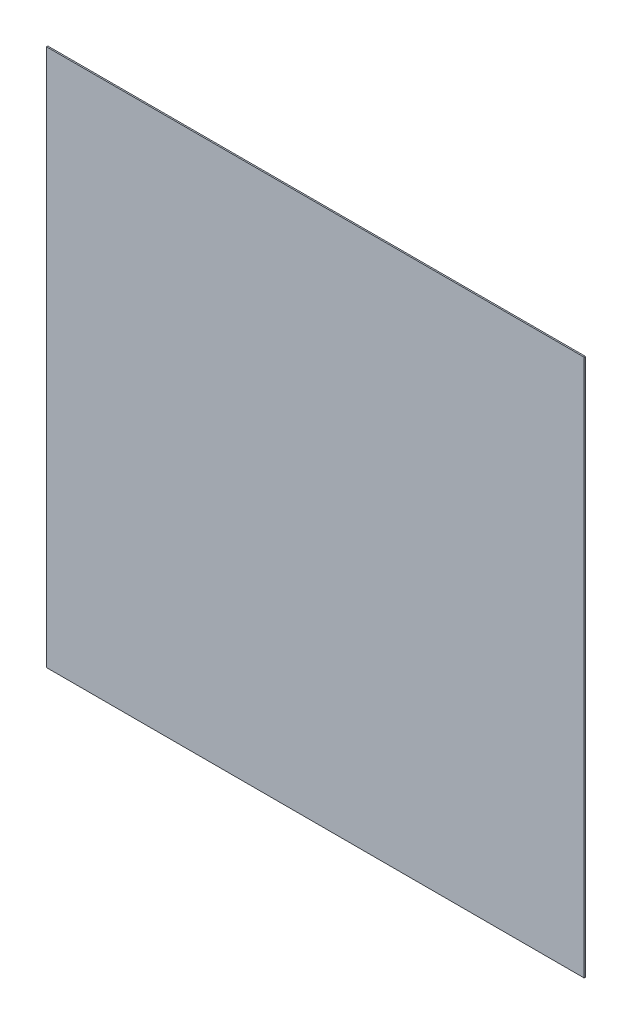
ISO-10303-21;
HEADER;
FILE_DESCRIPTION(('STEP AP214'),'2;1');
FILE_NAME('part.step','',(''),(''),'','','');
FILE_SCHEMA(('AUTOMOTIVE_DESIGN { 1 0 10303 214 1 1 1 1 }'));
ENDSEC;
DATA;
#1=APPLICATION_CONTEXT('core data for automotive mechanical design processes');
#2=APPLICATION_PROTOCOL_DEFINITION('international standard','automotive_design',2000,#1);
#3=PRODUCT_CONTEXT('',#1,'mechanical');
#4=PRODUCT('Part','Part','',(#3));
#5=PRODUCT_RELATED_PRODUCT_CATEGORY('part','',(#4));
#6=PRODUCT_DEFINITION_FORMATION('','',#4);
#7=PRODUCT_DEFINITION_CONTEXT('part definition',#1,'design');
#8=PRODUCT_DEFINITION('design','',#6,#7);
#9=PRODUCT_DEFINITION_SHAPE('','',#8);
#10=(LENGTH_UNIT() NAMED_UNIT(*) SI_UNIT(.MILLI.,.METRE.));
#11=(NAMED_UNIT(*) PLANE_ANGLE_UNIT() SI_UNIT($,.RADIAN.));
#12=(NAMED_UNIT(*) SI_UNIT($,.STERADIAN.) SOLID_ANGLE_UNIT());
#13=UNCERTAINTY_MEASURE_WITH_UNIT(LENGTH_MEASURE(1.E-05),#10,'distance_accuracy_value','');
#14=(GEOMETRIC_REPRESENTATION_CONTEXT(3) GLOBAL_UNCERTAINTY_ASSIGNED_CONTEXT((#13)) GLOBAL_UNIT_ASSIGNED_CONTEXT((#10,
#11,#12)) REPRESENTATION_CONTEXT('',''));
#15=CARTESIAN_POINT('',(0.,0.,0.));
#16=DIRECTION('',(0.,0.,1.));
#17=DIRECTION('',(1.,0.,0.));
#18=AXIS2_PLACEMENT_3D('',#15,#16,#17);
#19=CARTESIAN_POINT('',(0.,0.,1.));
#20=DIRECTION('',(1.,0.,0.));
#21=DIRECTION('',(0.,1.,0.));
#22=AXIS2_PLACEMENT_3D('',#19,#20,#21);
#23=PLANE('',#22);
#24=DIRECTION('',(0.,-1.,0.));
#25=VECTOR('',#24,1.);
#26=CARTESIAN_POINT('',(0.,0.,0.));
#27=LINE('',#26,#25);
#28=CARTESIAN_POINT('',(0.,0.,0.));
#29=VERTEX_POINT('',#28);
#30=CARTESIAN_POINT('',(0.,-400.,0.));
#31=VERTEX_POINT('',#30);
#32=EDGE_CURVE('E96',#29,#31,#27,.T.);
#33=ORIENTED_EDGE('',*,*,#32,.T.);
#34=DIRECTION('',(0.,0.,-1.));
#35=VECTOR('',#34,1.);
#36=CARTESIAN_POINT('',(0.,-400.,1.));
#37=LINE('',#36,#35);
#38=CARTESIAN_POINT('',(0.,-400.,1.));
#39=VERTEX_POINT('',#38);
#40=EDGE_CURVE('E11',#39,#31,#37,.T.);
#41=ORIENTED_EDGE('',*,*,#40,.F.);
#42=DIRECTION('',(0.,-1.,0.));
#43=VECTOR('',#42,1.);
#44=CARTESIAN_POINT('',(0.,0.,1.));
#45=LINE('',#44,#43);
#46=CARTESIAN_POINT('',(0.,0.,1.));
#47=VERTEX_POINT('',#46);
#48=EDGE_CURVE('E84',#47,#39,#45,.T.);
#49=ORIENTED_EDGE('',*,*,#48,.F.);
#50=DIRECTION('',(0.,0.,-1.));
#51=VECTOR('',#50,1.);
#52=CARTESIAN_POINT('',(0.,0.,1.));
#53=LINE('',#52,#51);
#54=EDGE_CURVE('E92',#47,#29,#53,.T.);
#55=ORIENTED_EDGE('',*,*,#54,.T.);
#56=EDGE_LOOP('',(#33,#41,#49,#55));
#57=FACE_BOUND('',#56,.T.);
#58=ADVANCED_FACE('F33',(#57),#23,.F.);
#59=CARTESIAN_POINT('',(0.,-400.,1.));
#60=DIRECTION('',(0.,1.,0.));
#61=DIRECTION('',(0.,0.,1.));
#62=AXIS2_PLACEMENT_3D('',#59,#60,#61);
#63=PLANE('',#62);
#64=DIRECTION('',(1.,0.,0.));
#65=VECTOR('',#64,1.);
#66=CARTESIAN_POINT('',(0.,-400.,0.));
#67=LINE('',#66,#65);
#68=CARTESIAN_POINT('',(400.,-400.,0.));
#69=VERTEX_POINT('',#68);
#70=EDGE_CURVE('E88',#31,#69,#67,.T.);
#71=ORIENTED_EDGE('',*,*,#70,.T.);
#72=DIRECTION('',(0.,0.,-1.));
#73=VECTOR('',#72,1.);
#74=CARTESIAN_POINT('',(400.,-400.,1.));
#75=LINE('',#74,#73);
#76=CARTESIAN_POINT('',(400.,-400.,1.));
#77=VERTEX_POINT('',#76);
#78=EDGE_CURVE('E41',#77,#69,#75,.T.);
#79=ORIENTED_EDGE('',*,*,#78,.F.);
#80=DIRECTION('',(1.,0.,0.));
#81=VECTOR('',#80,1.);
#82=CARTESIAN_POINT('',(0.,-400.,1.));
#83=LINE('',#82,#81);
#84=EDGE_CURVE('E79',#39,#77,#83,.T.);
#85=ORIENTED_EDGE('',*,*,#84,.F.);
#86=ORIENTED_EDGE('',*,*,#40,.T.);
#87=EDGE_LOOP('',(#71,#79,#85,#86));
#88=FACE_BOUND('',#87,.T.);
#89=ADVANCED_FACE('F87',(#88),#63,.F.);
#90=CARTESIAN_POINT('',(400.,0.,1.));
#91=DIRECTION('',(-1.,0.,0.));
#92=DIRECTION('',(0.,0.,1.));
#93=AXIS2_PLACEMENT_3D('',#90,#91,#92);
#94=PLANE('',#93);
#95=DIRECTION('',(0.,1.,0.));
#96=VECTOR('',#95,1.);
#97=CARTESIAN_POINT('',(400.,0.,0.));
#98=LINE('',#97,#96);
#99=CARTESIAN_POINT('',(400.,0.,0.));
#100=VERTEX_POINT('',#99);
#101=EDGE_CURVE('E66',#69,#100,#98,.T.);
#102=ORIENTED_EDGE('',*,*,#101,.T.);
#103=DIRECTION('',(0.,0.,-1.));
#104=VECTOR('',#103,1.);
#105=CARTESIAN_POINT('',(400.,0.,1.));
#106=LINE('',#105,#104);
#107=CARTESIAN_POINT('',(400.,0.,1.));
#108=VERTEX_POINT('',#107);
#109=EDGE_CURVE('E89',#108,#100,#106,.T.);
#110=ORIENTED_EDGE('',*,*,#109,.F.);
#111=DIRECTION('',(0.,1.,0.));
#112=VECTOR('',#111,1.);
#113=CARTESIAN_POINT('',(400.,0.,1.));
#114=LINE('',#113,#112);
#115=EDGE_CURVE('E82',#77,#108,#114,.T.);
#116=ORIENTED_EDGE('',*,*,#115,.F.);
#117=ORIENTED_EDGE('',*,*,#78,.T.);
#118=EDGE_LOOP('',(#102,#110,#116,#117));
#119=FACE_BOUND('',#118,.T.);
#120=ADVANCED_FACE('F90',(#119),#94,.F.);
#121=CARTESIAN_POINT('',(0.,0.,1.));
#122=DIRECTION('',(0.,-1.,0.));
#123=DIRECTION('',(0.,0.,-1.));
#124=AXIS2_PLACEMENT_3D('',#121,#122,#123);
#125=PLANE('',#124);
#126=DIRECTION('',(-1.,0.,0.));
#127=VECTOR('',#126,1.);
#128=CARTESIAN_POINT('',(0.,0.,0.));
#129=LINE('',#128,#127);
#130=EDGE_CURVE('E72',#100,#29,#129,.T.);
#131=ORIENTED_EDGE('',*,*,#130,.T.);
#132=ORIENTED_EDGE('',*,*,#54,.F.);
#133=DIRECTION('',(-1.,0.,0.));
#134=VECTOR('',#133,1.);
#135=CARTESIAN_POINT('',(0.,0.,1.));
#136=LINE('',#135,#134);
#137=EDGE_CURVE('E49',#108,#47,#136,.T.);
#138=ORIENTED_EDGE('',*,*,#137,.F.);
#139=ORIENTED_EDGE('',*,*,#109,.T.);
#140=EDGE_LOOP('',(#131,#132,#138,#139));
#141=FACE_BOUND('',#140,.T.);
#142=ADVANCED_FACE('F103',(#141),#125,.F.);
#143=CARTESIAN_POINT('',(0.,0.,1.));
#144=DIRECTION('',(0.,0.,1.));
#145=DIRECTION('',(1.,0.,0.));
#146=AXIS2_PLACEMENT_3D('',#143,#144,#145);
#147=PLANE('',#146);
#148=ORIENTED_EDGE('',*,*,#48,.T.);
#149=ORIENTED_EDGE('',*,*,#84,.T.);
#150=ORIENTED_EDGE('',*,*,#115,.T.);
#151=ORIENTED_EDGE('',*,*,#137,.T.);
#152=EDGE_LOOP('',(#148,#149,#150,#151));
#153=FACE_BOUND('',#152,.T.);
#154=ADVANCED_FACE('F80',(#153),#147,.T.);
#155=CARTESIAN_POINT('',(0.,0.,0.));
#156=DIRECTION('',(0.,0.,1.));
#157=DIRECTION('',(1.,0.,0.));
#158=AXIS2_PLACEMENT_3D('',#155,#156,#157);
#159=PLANE('',#158);
#160=ORIENTED_EDGE('',*,*,#32,.F.);
#161=ORIENTED_EDGE('',*,*,#130,.F.);
#162=ORIENTED_EDGE('',*,*,#101,.F.);
#163=ORIENTED_EDGE('',*,*,#70,.F.);
#164=EDGE_LOOP('',(#160,#161,#162,#163));
#165=FACE_BOUND('',#164,.T.);
#166=ADVANCED_FACE('F106',(#165),#159,.F.);
#167=CLOSED_SHELL('',(#58,#89,#120,#142,#154,#166));
#168=MANIFOLD_SOLID_BREP('B2',#167);
#169=ADVANCED_BREP_SHAPE_REPRESENTATION('',(#18,#168),#14);
#170=SHAPE_DEFINITION_REPRESENTATION(#9,#169);
ENDSEC;
END-ISO-10303-21;
